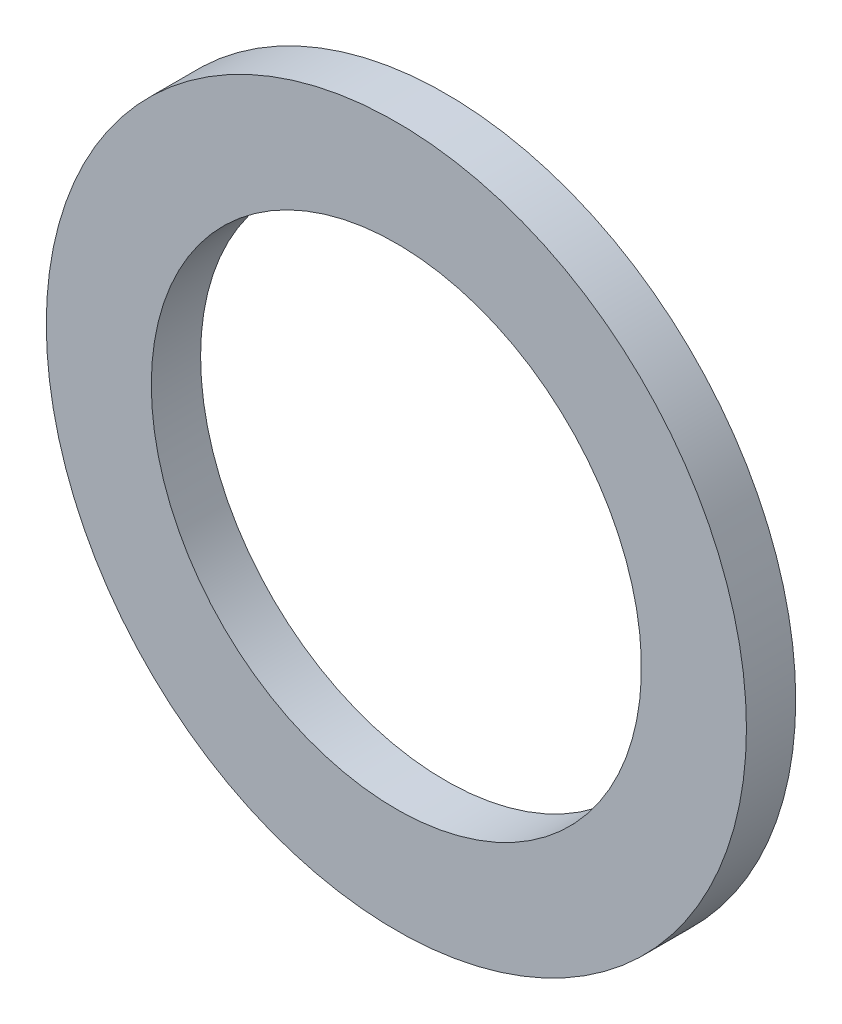
ISO-10303-21;
HEADER;
FILE_DESCRIPTION(('STEP AP214'),'2;1');
FILE_NAME('part.step','',(''),(''),'','','');
FILE_SCHEMA(('AUTOMOTIVE_DESIGN { 1 0 10303 214 1 1 1 1 }'));
ENDSEC;
DATA;
#1=APPLICATION_CONTEXT('core data for automotive mechanical design processes');
#2=APPLICATION_PROTOCOL_DEFINITION('international standard','automotive_design',2000,#1);
#3=PRODUCT_CONTEXT('',#1,'mechanical');
#4=PRODUCT('Part','Part','',(#3));
#5=PRODUCT_RELATED_PRODUCT_CATEGORY('part','',(#4));
#6=PRODUCT_DEFINITION_FORMATION('','',#4);
#7=PRODUCT_DEFINITION_CONTEXT('part definition',#1,'design');
#8=PRODUCT_DEFINITION('design','',#6,#7);
#9=PRODUCT_DEFINITION_SHAPE('','',#8);
#10=(LENGTH_UNIT() NAMED_UNIT(*) SI_UNIT(.MILLI.,.METRE.));
#11=(NAMED_UNIT(*) PLANE_ANGLE_UNIT() SI_UNIT($,.RADIAN.));
#12=(NAMED_UNIT(*) SI_UNIT($,.STERADIAN.) SOLID_ANGLE_UNIT());
#13=UNCERTAINTY_MEASURE_WITH_UNIT(LENGTH_MEASURE(1.E-05),#10,'distance_accuracy_value','');
#14=(GEOMETRIC_REPRESENTATION_CONTEXT(3) GLOBAL_UNCERTAINTY_ASSIGNED_CONTEXT((#13)) GLOBAL_UNIT_ASSIGNED_CONTEXT((#10,
#11,#12)) REPRESENTATION_CONTEXT('',''));
#15=CARTESIAN_POINT('',(0.,0.,0.));
#16=DIRECTION('',(0.,0.,1.));
#17=DIRECTION('',(1.,0.,0.));
#18=AXIS2_PLACEMENT_3D('',#15,#16,#17);
#19=CARTESIAN_POINT('',(0.,0.,0.5588));
#20=DIRECTION('',(0.,0.,1.));
#21=DIRECTION('',(1.,0.,0.));
#22=AXIS2_PLACEMENT_3D('',#19,#20,#21);
#23=PLANE('',#22);
#24=CARTESIAN_POINT('',(0.,0.,0.5588));
#25=DIRECTION('',(0.,0.,-1.));
#26=DIRECTION('',(-1.,0.,0.));
#27=AXIS2_PLACEMENT_3D('',#24,#25,#26);
#28=CIRCLE('',#27,5.55625);
#29=CARTESIAN_POINT('',(-5.55625,0.,0.5588));
#30=VERTEX_POINT('',#29);
#31=EDGE_CURVE('E27',#30,#30,#28,.T.);
#32=ORIENTED_EDGE('',*,*,#31,.T.);
#33=EDGE_LOOP('',(#32));
#34=FACE_BOUND('',#33,.T.);
#35=CARTESIAN_POINT('',(0.,0.,0.5588));
#36=DIRECTION('',(0.,0.,-1.));
#37=DIRECTION('',(-1.,0.,0.));
#38=AXIS2_PLACEMENT_3D('',#35,#36,#37);
#39=CIRCLE('',#38,7.9375);
#40=CARTESIAN_POINT('',(-7.9375,0.,0.5588));
#41=VERTEX_POINT('',#40);
#42=EDGE_CURVE('E18',#41,#41,#39,.T.);
#43=ORIENTED_EDGE('',*,*,#42,.F.);
#44=EDGE_LOOP('',(#43));
#45=FACE_BOUND('',#44,.T.);
#46=ADVANCED_FACE('F15',(#34,#45),#23,.T.);
#47=CARTESIAN_POINT('',(0.,0.,0.5588));
#48=DIRECTION('',(0.,0.,-1.));
#49=DIRECTION('',(-1.,0.,0.));
#50=AXIS2_PLACEMENT_3D('',#47,#48,#49);
#51=CYLINDRICAL_SURFACE('',#50,7.9375);
#52=ORIENTED_EDGE('',*,*,#42,.T.);
#53=EDGE_LOOP('',(#52));
#54=FACE_BOUND('',#53,.T.);
#55=CARTESIAN_POINT('',(0.,0.,-0.558799999532));
#56=DIRECTION('',(0.,0.,-1.));
#57=DIRECTION('',(-1.,0.,0.));
#58=AXIS2_PLACEMENT_3D('',#55,#56,#57);
#59=CIRCLE('',#58,7.9375);
#60=CARTESIAN_POINT('',(-7.9375,0.,-0.558799999532));
#61=VERTEX_POINT('',#60);
#62=EDGE_CURVE('E22',#61,#61,#59,.F.);
#63=ORIENTED_EDGE('',*,*,#62,.T.);
#64=EDGE_LOOP('',(#63));
#65=FACE_BOUND('',#64,.T.);
#66=ADVANCED_FACE('F35',(#54,#65),#51,.T.);
#67=CARTESIAN_POINT('',(0.,0.,0.5588));
#68=DIRECTION('',(0.,0.,-1.));
#69=DIRECTION('',(-1.,0.,0.));
#70=AXIS2_PLACEMENT_3D('',#67,#68,#69);
#71=CYLINDRICAL_SURFACE('',#70,5.55625);
#72=CARTESIAN_POINT('',(0.,0.,-0.558799999532));
#73=DIRECTION('',(0.,0.,-1.));
#74=DIRECTION('',(-1.,0.,0.));
#75=AXIS2_PLACEMENT_3D('',#72,#73,#74);
#76=CIRCLE('',#75,5.55625);
#77=CARTESIAN_POINT('',(-5.55625,0.,-0.558799999532));
#78=VERTEX_POINT('',#77);
#79=EDGE_CURVE('E10',#78,#78,#76,.T.);
#80=ORIENTED_EDGE('',*,*,#79,.T.);
#81=EDGE_LOOP('',(#80));
#82=FACE_BOUND('',#81,.T.);
#83=ORIENTED_EDGE('',*,*,#31,.F.);
#84=EDGE_LOOP('',(#83));
#85=FACE_BOUND('',#84,.T.);
#86=ADVANCED_FACE('F43',(#82,#85),#71,.F.);
#87=CARTESIAN_POINT('',(0.,0.,-0.5588));
#88=DIRECTION('',(0.,0.,1.));
#89=DIRECTION('',(1.,0.,0.));
#90=AXIS2_PLACEMENT_3D('',#87,#88,#89);
#91=PLANE('',#90);
#92=ORIENTED_EDGE('',*,*,#79,.F.);
#93=EDGE_LOOP('',(#92));
#94=FACE_BOUND('',#93,.T.);
#95=ORIENTED_EDGE('',*,*,#62,.F.);
#96=EDGE_LOOP('',(#95));
#97=FACE_BOUND('',#96,.T.);
#98=ADVANCED_FACE('F44',(#94,#97),#91,.F.);
#99=CLOSED_SHELL('',(#46,#66,#86,#98));
#100=MANIFOLD_SOLID_BREP('B1',#99);
#101=ADVANCED_BREP_SHAPE_REPRESENTATION('',(#18,#100),#14);
#102=SHAPE_DEFINITION_REPRESENTATION(#9,#101);
ENDSEC;
END-ISO-10303-21;
